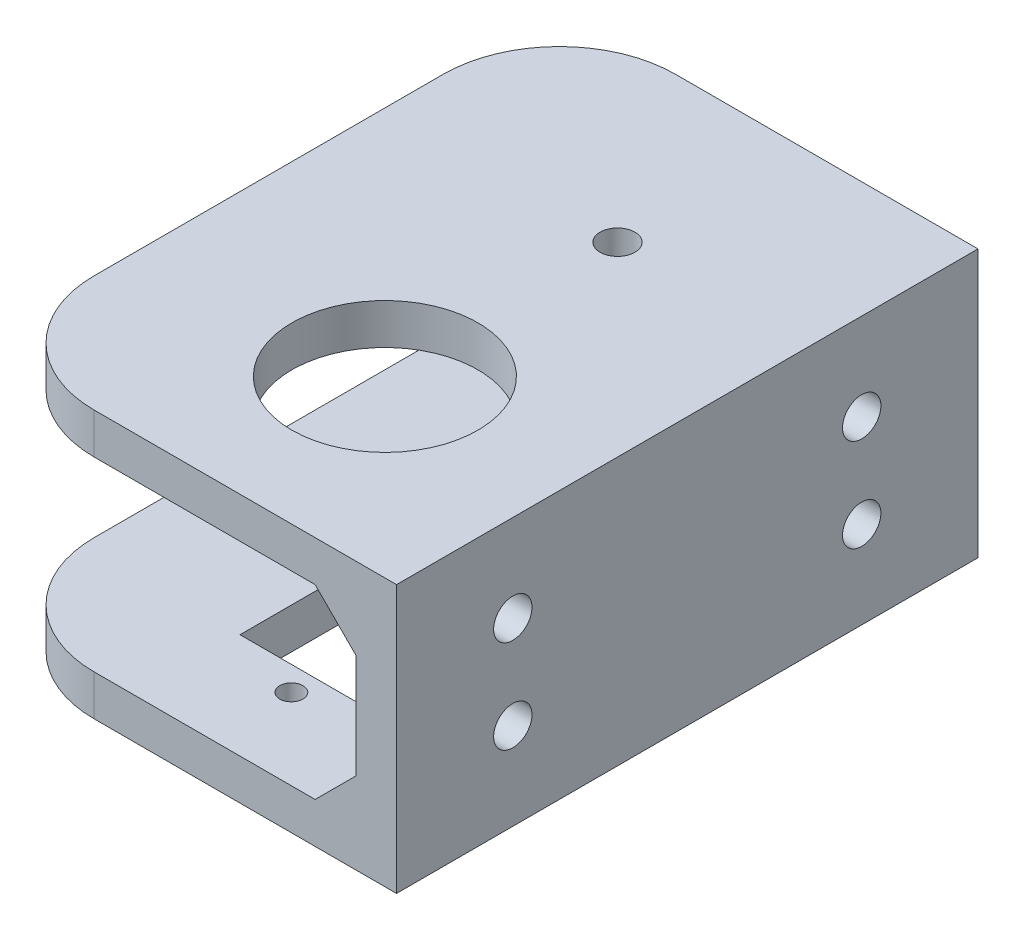
ISO-10303-21;
HEADER;
FILE_DESCRIPTION(('STEP AP214'),'2;1');
FILE_NAME('part.step','',(''),(''),'','','');
FILE_SCHEMA(('AUTOMOTIVE_DESIGN { 1 0 10303 214 1 1 1 1 }'));
ENDSEC;
DATA;
#1=APPLICATION_CONTEXT('core data for automotive mechanical design processes');
#2=APPLICATION_PROTOCOL_DEFINITION('international standard','automotive_design',2000,#1);
#3=PRODUCT_CONTEXT('',#1,'mechanical');
#4=PRODUCT('Part','Part','',(#3));
#5=PRODUCT_RELATED_PRODUCT_CATEGORY('part','',(#4));
#6=PRODUCT_DEFINITION_FORMATION('','',#4);
#7=PRODUCT_DEFINITION_CONTEXT('part definition',#1,'design');
#8=PRODUCT_DEFINITION('design','',#6,#7);
#9=PRODUCT_DEFINITION_SHAPE('','',#8);
#10=(LENGTH_UNIT() NAMED_UNIT(*) SI_UNIT(.MILLI.,.METRE.));
#11=(NAMED_UNIT(*) PLANE_ANGLE_UNIT() SI_UNIT($,.RADIAN.));
#12=(NAMED_UNIT(*) SI_UNIT($,.STERADIAN.) SOLID_ANGLE_UNIT());
#13=UNCERTAINTY_MEASURE_WITH_UNIT(LENGTH_MEASURE(1.E-05),#10,'distance_accuracy_value','');
#14=(GEOMETRIC_REPRESENTATION_CONTEXT(3) GLOBAL_UNCERTAINTY_ASSIGNED_CONTEXT((#13)) GLOBAL_UNIT_ASSIGNED_CONTEXT((#10,
#11,#12)) REPRESENTATION_CONTEXT('',''));
#15=CARTESIAN_POINT('',(0.,0.,0.));
#16=DIRECTION('',(0.,0.,1.));
#17=DIRECTION('',(1.,0.,0.));
#18=AXIS2_PLACEMENT_3D('',#15,#16,#17);
#19=CARTESIAN_POINT('',(-45.,8.,50.));
#20=DIRECTION('',(0.,1.,0.));
#21=DIRECTION('',(0.,0.,1.));
#22=AXIS2_PLACEMENT_3D('',#19,#20,#21);
#23=PLANE('',#22);
#24=CARTESIAN_POINT('',(-16.,8.,35.));
#25=DIRECTION('',(0.,1.,0.));
#26=DIRECTION('',(0.,0.,1.));
#27=AXIS2_PLACEMENT_3D('',#24,#25,#26);
#28=CIRCLE('',#27,8.);
#29=CARTESIAN_POINT('',(-16.,8.,43.));
#30=VERTEX_POINT('',#29);
#31=EDGE_CURVE('E395',#30,#30,#28,.T.);
#32=ORIENTED_EDGE('',*,*,#31,.T.);
#33=EDGE_LOOP('',(#32));
#34=FACE_BOUND('',#33,.T.);
#35=CARTESIAN_POINT('',(-16.,8.,15.));
#36=DIRECTION('',(0.,1.,0.));
#37=DIRECTION('',(0.,0.,1.));
#38=AXIS2_PLACEMENT_3D('',#35,#36,#37);
#39=CIRCLE('',#38,1.5);
#40=CARTESIAN_POINT('',(-16.,8.,16.5));
#41=VERTEX_POINT('',#40);
#42=EDGE_CURVE('E235',#41,#41,#39,.T.);
#43=ORIENTED_EDGE('',*,*,#42,.T.);
#44=EDGE_LOOP('',(#43));
#45=FACE_BOUND('',#44,.T.);
#46=DIRECTION('',(-1.,0.,0.));
#47=VECTOR('',#46,1.);
#48=CARTESIAN_POINT('',(-3.5,8.,46.5));
#49=LINE('',#48,#47);
#50=CARTESIAN_POINT('',(-3.5,8.,46.5));
#51=VERTEX_POINT('',#50);
#52=CARTESIAN_POINT('',(-7.,8.,46.5));
#53=VERTEX_POINT('',#52);
#54=EDGE_CURVE('E438',#51,#53,#49,.T.);
#55=ORIENTED_EDGE('',*,*,#54,.T.);
#56=DIRECTION('',(0.,0.,1.));
#57=VECTOR('',#56,1.);
#58=CARTESIAN_POINT('',(-7.,8.,46.5));
#59=LINE('',#58,#57);
#60=CARTESIAN_POINT('',(-7.,8.,50.));
#61=VERTEX_POINT('',#60);
#62=EDGE_CURVE('E429',#53,#61,#59,.T.);
#63=ORIENTED_EDGE('',*,*,#62,.T.);
#64=DIRECTION('',(1.,0.,0.));
#65=VECTOR('',#64,1.);
#66=CARTESIAN_POINT('',(-45.,8.,50.));
#67=LINE('',#66,#65);
#68=CARTESIAN_POINT('',(-25.9999999999999,8.,50.));
#69=VERTEX_POINT('',#68);
#70=EDGE_CURVE('E283',#69,#61,#67,.T.);
#71=ORIENTED_EDGE('',*,*,#70,.F.);
#72=CARTESIAN_POINT('',(-26.,8.,40.));
#73=DIRECTION('',(0.,1.,0.));
#74=DIRECTION('',(0.,0.,1.));
#75=AXIS2_PLACEMENT_3D('',#72,#73,#74);
#76=CIRCLE('',#75,10.);
#77=CARTESIAN_POINT('',(-36.,8.,39.9999999999999));
#78=VERTEX_POINT('',#77);
#79=EDGE_CURVE('E304',#78,#69,#76,.T.);
#80=ORIENTED_EDGE('',*,*,#79,.F.);
#81=DIRECTION('',(0.,0.,1.));
#82=VECTOR('',#81,1.);
#83=CARTESIAN_POINT('',(-36.,8.,50.));
#84=LINE('',#83,#82);
#85=CARTESIAN_POINT('',(-36.,8.,10.0000000000001));
#86=VERTEX_POINT('',#85);
#87=EDGE_CURVE('E260',#86,#78,#84,.T.);
#88=ORIENTED_EDGE('',*,*,#87,.F.);
#89=CARTESIAN_POINT('',(-26.,8.,10.));
#90=DIRECTION('',(0.,1.,0.));
#91=DIRECTION('',(0.,0.,1.));
#92=AXIS2_PLACEMENT_3D('',#89,#90,#91);
#93=CIRCLE('',#92,10.);
#94=CARTESIAN_POINT('',(-25.9999999999999,8.,0.));
#95=VERTEX_POINT('',#94);
#96=EDGE_CURVE('E247',#95,#86,#93,.T.);
#97=ORIENTED_EDGE('',*,*,#96,.F.);
#98=DIRECTION('',(1.,0.,0.));
#99=VECTOR('',#98,1.);
#100=CARTESIAN_POINT('',(-45.,8.,0.));
#101=LINE('',#100,#99);
#102=CARTESIAN_POINT('',(-7.00000000000001,8.,0.));
#103=VERTEX_POINT('',#102);
#104=EDGE_CURVE('E234',#95,#103,#101,.T.);
#105=ORIENTED_EDGE('',*,*,#104,.T.);
#106=DIRECTION('',(0.,0.,-1.));
#107=VECTOR('',#106,1.);
#108=CARTESIAN_POINT('',(-7.,8.,3.5));
#109=LINE('',#108,#107);
#110=CARTESIAN_POINT('',(-7.,8.,3.5));
#111=VERTEX_POINT('',#110);
#112=EDGE_CURVE('E402',#111,#103,#109,.T.);
#113=ORIENTED_EDGE('',*,*,#112,.F.);
#114=DIRECTION('',(1.,0.,0.));
#115=VECTOR('',#114,1.);
#116=CARTESIAN_POINT('',(-3.5,8.,3.5));
#117=LINE('',#116,#115);
#118=CARTESIAN_POINT('',(-3.5,8.,3.5));
#119=VERTEX_POINT('',#118);
#120=EDGE_CURVE('E411',#111,#119,#117,.T.);
#121=ORIENTED_EDGE('',*,*,#120,.T.);
#122=DIRECTION('',(0.,0.,-1.));
#123=VECTOR('',#122,1.);
#124=CARTESIAN_POINT('',(-3.5,8.,50.));
#125=LINE('',#124,#123);
#126=EDGE_CURVE('E221',#51,#119,#125,.T.);
#127=ORIENTED_EDGE('',*,*,#126,.F.);
#128=EDGE_LOOP('',(#55,#63,#71,#80,#88,#97,#105,#113,#121,#127));
#129=FACE_BOUND('',#128,.T.);
#130=ADVANCED_FACE('F40',(#34,#45,#129),#23,.F.);
#131=CARTESIAN_POINT('',(-3.5,-8.,50.));
#132=DIRECTION('',(0.,-1.,0.));
#133=DIRECTION('',(1.,0.,0.));
#134=AXIS2_PLACEMENT_3D('',#131,#132,#133);
#135=PLANE('',#134);
#136=DIRECTION('',(-1.,0.,0.));
#137=VECTOR('',#136,1.);
#138=CARTESIAN_POINT('',(-3.5,-8.,40.96));
#139=LINE('',#138,#137);
#140=CARTESIAN_POINT('',(-9.5,-8.,40.96));
#141=VERTEX_POINT('',#140);
#142=CARTESIAN_POINT('',(-22.5,-8.,40.96));
#143=VERTEX_POINT('',#142);
#144=EDGE_CURVE('E342',#141,#143,#139,.T.);
#145=ORIENTED_EDGE('',*,*,#144,.T.);
#146=DIRECTION('',(0.,0.,-1.));
#147=VECTOR('',#146,1.);
#148=CARTESIAN_POINT('',(-22.5,-8.,50.));
#149=LINE('',#148,#147);
#150=CARTESIAN_POINT('',(-22.5,-8.,17.46));
#151=VERTEX_POINT('',#150);
#152=EDGE_CURVE('E337',#143,#151,#149,.T.);
#153=ORIENTED_EDGE('',*,*,#152,.T.);
#154=DIRECTION('',(1.,0.,0.));
#155=VECTOR('',#154,1.);
#156=CARTESIAN_POINT('',(-3.49999999999999,-8.,17.46));
#157=LINE('',#156,#155);
#158=CARTESIAN_POINT('',(-9.5,-8.,17.46));
#159=VERTEX_POINT('',#158);
#160=EDGE_CURVE('E348',#151,#159,#157,.T.);
#161=ORIENTED_EDGE('',*,*,#160,.T.);
#162=DIRECTION('',(0.,0.,1.));
#163=VECTOR('',#162,1.);
#164=CARTESIAN_POINT('',(-9.5,-8.,50.));
#165=LINE('',#164,#163);
#166=EDGE_CURVE('E345',#159,#141,#165,.T.);
#167=ORIENTED_EDGE('',*,*,#166,.T.);
#168=EDGE_LOOP('',(#145,#153,#161,#167));
#169=FACE_BOUND('',#168,.T.);
#170=CARTESIAN_POINT('',(-16.,-8.,43.045));
#171=DIRECTION('',(0.,-1.,0.));
#172=DIRECTION('',(1.,0.,0.));
#173=AXIS2_PLACEMENT_3D('',#170,#171,#172);
#174=CIRCLE('',#173,1.);
#175=CARTESIAN_POINT('',(-15.,-8.,43.045));
#176=VERTEX_POINT('',#175);
#177=EDGE_CURVE('E327',#176,#176,#174,.T.);
#178=ORIENTED_EDGE('',*,*,#177,.T.);
#179=EDGE_LOOP('',(#178));
#180=FACE_BOUND('',#179,.T.);
#181=CARTESIAN_POINT('',(-16.,-8.,15.375));
#182=DIRECTION('',(0.,-1.,0.));
#183=DIRECTION('',(1.,0.,0.));
#184=AXIS2_PLACEMENT_3D('',#181,#182,#183);
#185=CIRCLE('',#184,1.);
#186=CARTESIAN_POINT('',(-15.,-8.,15.375));
#187=VERTEX_POINT('',#186);
#188=EDGE_CURVE('E330',#187,#187,#185,.T.);
#189=ORIENTED_EDGE('',*,*,#188,.T.);
#190=EDGE_LOOP('',(#189));
#191=FACE_BOUND('',#190,.T.);
#192=DIRECTION('',(-1.,0.,0.));
#193=VECTOR('',#192,1.);
#194=CARTESIAN_POINT('',(-3.5,-8.,50.));
#195=LINE('',#194,#193);
#196=CARTESIAN_POINT('',(-7.,-8.,50.));
#197=VERTEX_POINT('',#196);
#198=CARTESIAN_POINT('',(-25.9999999999999,-8.00000000000001,50.));
#199=VERTEX_POINT('',#198);
#200=EDGE_CURVE('E292',#197,#199,#195,.T.);
#201=ORIENTED_EDGE('',*,*,#200,.F.);
#202=DIRECTION('',(0.,0.,1.));
#203=VECTOR('',#202,1.);
#204=CARTESIAN_POINT('',(-7.,-8.,46.5));
#205=LINE('',#204,#203);
#206=CARTESIAN_POINT('',(-7.,-8.,46.5));
#207=VERTEX_POINT('',#206);
#208=EDGE_CURVE('E215',#207,#197,#205,.T.);
#209=ORIENTED_EDGE('',*,*,#208,.F.);
#210=DIRECTION('',(1.,0.,0.));
#211=VECTOR('',#210,1.);
#212=CARTESIAN_POINT('',(-7.,-8.,46.5));
#213=LINE('',#212,#211);
#214=CARTESIAN_POINT('',(-3.5,-8.,46.5));
#215=VERTEX_POINT('',#214);
#216=EDGE_CURVE('E203',#207,#215,#213,.T.);
#217=ORIENTED_EDGE('',*,*,#216,.T.);
#218=DIRECTION('',(0.,0.,-1.));
#219=VECTOR('',#218,1.);
#220=CARTESIAN_POINT('',(-3.5,-8.,50.));
#221=LINE('',#220,#219);
#222=CARTESIAN_POINT('',(-3.5,-8.,3.5));
#223=VERTEX_POINT('',#222);
#224=EDGE_CURVE('E213',#215,#223,#221,.T.);
#225=ORIENTED_EDGE('',*,*,#224,.T.);
#226=DIRECTION('',(-1.,0.,0.));
#227=VECTOR('',#226,1.);
#228=CARTESIAN_POINT('',(-3.5,-8.,3.5));
#229=LINE('',#228,#227);
#230=CARTESIAN_POINT('',(-7.,-8.,3.5));
#231=VERTEX_POINT('',#230);
#232=EDGE_CURVE('E62',#223,#231,#229,.T.);
#233=ORIENTED_EDGE('',*,*,#232,.T.);
#234=DIRECTION('',(0.,0.,-1.));
#235=VECTOR('',#234,1.);
#236=CARTESIAN_POINT('',(-7.,-8.,3.5));
#237=LINE('',#236,#235);
#238=CARTESIAN_POINT('',(-7.,-8.,0.));
#239=VERTEX_POINT('',#238);
#240=EDGE_CURVE('E416',#231,#239,#237,.T.);
#241=ORIENTED_EDGE('',*,*,#240,.T.);
#242=DIRECTION('',(-1.,0.,0.));
#243=VECTOR('',#242,1.);
#244=CARTESIAN_POINT('',(-3.5,-8.,0.));
#245=LINE('',#244,#243);
#246=CARTESIAN_POINT('',(-26.,-8.,0.));
#247=VERTEX_POINT('',#246);
#248=EDGE_CURVE('E271',#239,#247,#245,.T.);
#249=ORIENTED_EDGE('',*,*,#248,.T.);
#250=CARTESIAN_POINT('',(-26.,-7.99999999999999,10.));
#251=DIRECTION('',(0.,-1.,0.));
#252=DIRECTION('',(1.,0.,0.));
#253=AXIS2_PLACEMENT_3D('',#250,#251,#252);
#254=CIRCLE('',#253,10.);
#255=CARTESIAN_POINT('',(-36.,-8.00000000000001,10.0000000000001));
#256=VERTEX_POINT('',#255);
#257=EDGE_CURVE('E262',#256,#247,#254,.T.);
#258=ORIENTED_EDGE('',*,*,#257,.F.);
#259=DIRECTION('',(0.,0.,-1.));
#260=VECTOR('',#259,1.);
#261=CARTESIAN_POINT('',(-36.,-8.,50.));
#262=LINE('',#261,#260);
#263=CARTESIAN_POINT('',(-36.,-7.99999999999999,39.9999999999999));
#264=VERTEX_POINT('',#263);
#265=EDGE_CURVE('E302',#264,#256,#262,.T.);
#266=ORIENTED_EDGE('',*,*,#265,.F.);
#267=CARTESIAN_POINT('',(-26.,-7.99999999999999,40.));
#268=DIRECTION('',(0.,-1.,0.));
#269=DIRECTION('',(1.,0.,0.));
#270=AXIS2_PLACEMENT_3D('',#267,#268,#269);
#271=CIRCLE('',#270,10.);
#272=EDGE_CURVE('E306',#199,#264,#271,.T.);
#273=ORIENTED_EDGE('',*,*,#272,.F.);
#274=EDGE_LOOP('',(#201,#209,#217,#225,#233,#241,#249,#258,#266,#273));
#275=FACE_BOUND('',#274,.T.);
#276=ADVANCED_FACE('F212',(#169,#180,#191,#275),#135,.F.);
#277=CARTESIAN_POINT('',(0.,-11.5,50.));
#278=DIRECTION('',(0.,1.,0.));
#279=DIRECTION('',(0.,0.,1.));
#280=AXIS2_PLACEMENT_3D('',#277,#278,#279);
#281=PLANE('',#280);
#282=DIRECTION('',(1.,0.,0.));
#283=VECTOR('',#282,1.);
#284=CARTESIAN_POINT('',(-9.5,-11.5,17.46));
#285=LINE('',#284,#283);
#286=CARTESIAN_POINT('',(-22.5,-11.5,17.46));
#287=VERTEX_POINT('',#286);
#288=CARTESIAN_POINT('',(-9.5,-11.5,17.46));
#289=VERTEX_POINT('',#288);
#290=EDGE_CURVE('E366',#287,#289,#285,.T.);
#291=ORIENTED_EDGE('',*,*,#290,.F.);
#292=DIRECTION('',(0.,0.,-1.));
#293=VECTOR('',#292,1.);
#294=CARTESIAN_POINT('',(-22.5,-11.5,17.46));
#295=LINE('',#294,#293);
#296=CARTESIAN_POINT('',(-22.5,-11.5,40.96));
#297=VERTEX_POINT('',#296);
#298=EDGE_CURVE('E369',#297,#287,#295,.T.);
#299=ORIENTED_EDGE('',*,*,#298,.F.);
#300=DIRECTION('',(-1.,0.,0.));
#301=VECTOR('',#300,1.);
#302=CARTESIAN_POINT('',(-9.5,-11.5,40.96));
#303=LINE('',#302,#301);
#304=CARTESIAN_POINT('',(-9.5,-11.5,40.96));
#305=VERTEX_POINT('',#304);
#306=EDGE_CURVE('E356',#305,#297,#303,.T.);
#307=ORIENTED_EDGE('',*,*,#306,.F.);
#308=DIRECTION('',(0.,0.,1.));
#309=VECTOR('',#308,1.);
#310=CARTESIAN_POINT('',(-9.5,-11.5,17.46));
#311=LINE('',#310,#309);
#312=EDGE_CURVE('E363',#289,#305,#311,.T.);
#313=ORIENTED_EDGE('',*,*,#312,.F.);
#314=EDGE_LOOP('',(#291,#299,#307,#313));
#315=FACE_BOUND('',#314,.T.);
#316=CARTESIAN_POINT('',(-16.,-11.5,43.045));
#317=DIRECTION('',(0.,-1.,0.));
#318=DIRECTION('',(0.,0.,-1.));
#319=AXIS2_PLACEMENT_3D('',#316,#317,#318);
#320=CIRCLE('',#319,1.);
#321=CARTESIAN_POINT('',(-16.,-11.5,42.045));
#322=VERTEX_POINT('',#321);
#323=EDGE_CURVE('E333',#322,#322,#320,.T.);
#324=ORIENTED_EDGE('',*,*,#323,.F.);
#325=EDGE_LOOP('',(#324));
#326=FACE_BOUND('',#325,.T.);
#327=CARTESIAN_POINT('',(-16.,-11.5,15.375));
#328=DIRECTION('',(0.,-1.,0.));
#329=DIRECTION('',(0.,0.,-1.));
#330=AXIS2_PLACEMENT_3D('',#327,#328,#329);
#331=CIRCLE('',#330,1.);
#332=CARTESIAN_POINT('',(-16.,-11.5,14.375));
#333=VERTEX_POINT('',#332);
#334=EDGE_CURVE('E334',#333,#333,#331,.T.);
#335=ORIENTED_EDGE('',*,*,#334,.F.);
#336=EDGE_LOOP('',(#335));
#337=FACE_BOUND('',#336,.T.);
#338=CARTESIAN_POINT('',(-26.,-11.5,10.));
#339=DIRECTION('',(0.,-1.,0.));
#340=DIRECTION('',(0.,0.,1.));
#341=AXIS2_PLACEMENT_3D('',#338,#339,#340);
#342=CIRCLE('',#341,10.);
#343=CARTESIAN_POINT('',(-36.,-11.5,10.0000000000001));
#344=VERTEX_POINT('',#343);
#345=CARTESIAN_POINT('',(-25.9999999999999,-11.5,0.));
#346=VERTEX_POINT('',#345);
#347=EDGE_CURVE('E324',#344,#346,#342,.T.);
#348=ORIENTED_EDGE('',*,*,#347,.T.);
#349=DIRECTION('',(1.,0.,0.));
#350=VECTOR('',#349,1.);
#351=CARTESIAN_POINT('',(0.,-11.5,0.));
#352=LINE('',#351,#350);
#353=CARTESIAN_POINT('',(0.,-11.5,0.));
#354=VERTEX_POINT('',#353);
#355=EDGE_CURVE('E278',#346,#354,#352,.T.);
#356=ORIENTED_EDGE('',*,*,#355,.T.);
#357=DIRECTION('',(0.,0.,-1.));
#358=VECTOR('',#357,1.);
#359=CARTESIAN_POINT('',(0.,-11.5,50.));
#360=LINE('',#359,#358);
#361=CARTESIAN_POINT('',(0.,-11.5,50.));
#362=VERTEX_POINT('',#361);
#363=EDGE_CURVE('E222',#362,#354,#360,.T.);
#364=ORIENTED_EDGE('',*,*,#363,.F.);
#365=DIRECTION('',(1.,0.,0.));
#366=VECTOR('',#365,1.);
#367=CARTESIAN_POINT('',(0.,-11.5,50.));
#368=LINE('',#367,#366);
#369=CARTESIAN_POINT('',(-25.9999999999999,-11.5,50.));
#370=VERTEX_POINT('',#369);
#371=EDGE_CURVE('E290',#370,#362,#368,.T.);
#372=ORIENTED_EDGE('',*,*,#371,.F.);
#373=CARTESIAN_POINT('',(-26.,-11.5,40.));
#374=DIRECTION('',(0.,-1.,0.));
#375=DIRECTION('',(0.,0.,1.));
#376=AXIS2_PLACEMENT_3D('',#373,#374,#375);
#377=CIRCLE('',#376,10.);
#378=CARTESIAN_POINT('',(-36.,-11.5,39.9999999999999));
#379=VERTEX_POINT('',#378);
#380=EDGE_CURVE('E321',#370,#379,#377,.T.);
#381=ORIENTED_EDGE('',*,*,#380,.T.);
#382=DIRECTION('',(0.,0.,-1.));
#383=VECTOR('',#382,1.);
#384=CARTESIAN_POINT('',(-36.,-11.5,10.0000000000001));
#385=LINE('',#384,#383);
#386=EDGE_CURVE('E316',#379,#344,#385,.T.);
#387=ORIENTED_EDGE('',*,*,#386,.T.);
#388=EDGE_LOOP('',(#348,#356,#364,#372,#381,#387));
#389=FACE_BOUND('',#388,.T.);
#390=ADVANCED_FACE('F464',(#315,#326,#337,#389),#281,.F.);
#391=CARTESIAN_POINT('',(-45.,11.5,50.));
#392=DIRECTION('',(0.,-1.,0.));
#393=DIRECTION('',(0.,0.,-1.));
#394=AXIS2_PLACEMENT_3D('',#391,#392,#393);
#395=PLANE('',#394);
#396=CARTESIAN_POINT('',(-16.,11.5,35.));
#397=DIRECTION('',(0.,1.,0.));
#398=DIRECTION('',(0.,0.,1.));
#399=AXIS2_PLACEMENT_3D('',#396,#397,#398);
#400=CIRCLE('',#399,8.);
#401=CARTESIAN_POINT('',(-16.,11.5,43.));
#402=VERTEX_POINT('',#401);
#403=EDGE_CURVE('E398',#402,#402,#400,.T.);
#404=ORIENTED_EDGE('',*,*,#403,.F.);
#405=EDGE_LOOP('',(#404));
#406=FACE_BOUND('',#405,.T.);
#407=CARTESIAN_POINT('',(-16.,11.5,15.));
#408=DIRECTION('',(0.,-1.,0.));
#409=DIRECTION('',(0.,0.,-1.));
#410=AXIS2_PLACEMENT_3D('',#407,#408,#409);
#411=CIRCLE('',#410,1.5);
#412=CARTESIAN_POINT('',(-16.,11.5,13.5));
#413=VERTEX_POINT('',#412);
#414=EDGE_CURVE('E231',#413,#413,#411,.F.);
#415=ORIENTED_EDGE('',*,*,#414,.F.);
#416=EDGE_LOOP('',(#415));
#417=FACE_BOUND('',#416,.T.);
#418=CARTESIAN_POINT('',(-26.,11.5,10.));
#419=DIRECTION('',(0.,-1.,0.));
#420=DIRECTION('',(0.,0.,-1.));
#421=AXIS2_PLACEMENT_3D('',#418,#419,#420);
#422=CIRCLE('',#421,10.);
#423=CARTESIAN_POINT('',(-36.,11.5,10.0000000000001));
#424=VERTEX_POINT('',#423);
#425=CARTESIAN_POINT('',(-26.,11.5,0.));
#426=VERTEX_POINT('',#425);
#427=EDGE_CURVE('E250',#424,#426,#422,.T.);
#428=ORIENTED_EDGE('',*,*,#427,.F.);
#429=DIRECTION('',(0.,0.,-1.));
#430=VECTOR('',#429,1.);
#431=CARTESIAN_POINT('',(-36.,11.5,50.));
#432=LINE('',#431,#430);
#433=CARTESIAN_POINT('',(-36.,11.5,39.9999999999999));
#434=VERTEX_POINT('',#433);
#435=EDGE_CURVE('E12',#434,#424,#432,.T.);
#436=ORIENTED_EDGE('',*,*,#435,.F.);
#437=CARTESIAN_POINT('',(-26.,11.5,40.));
#438=DIRECTION('',(0.,-1.,0.));
#439=DIRECTION('',(0.,0.,-1.));
#440=AXIS2_PLACEMENT_3D('',#437,#438,#439);
#441=CIRCLE('',#440,10.);
#442=CARTESIAN_POINT('',(-25.9999999999999,11.5,50.));
#443=VERTEX_POINT('',#442);
#444=EDGE_CURVE('E261',#443,#434,#441,.T.);
#445=ORIENTED_EDGE('',*,*,#444,.F.);
#446=DIRECTION('',(-1.,0.,0.));
#447=VECTOR('',#446,1.);
#448=CARTESIAN_POINT('',(-45.,11.5,50.));
#449=LINE('',#448,#447);
#450=CARTESIAN_POINT('',(0.,11.5,50.));
#451=VERTEX_POINT('',#450);
#452=EDGE_CURVE('E274',#451,#443,#449,.T.);
#453=ORIENTED_EDGE('',*,*,#452,.F.);
#454=DIRECTION('',(0.,0.,-1.));
#455=VECTOR('',#454,1.);
#456=CARTESIAN_POINT('',(0.,11.5,50.));
#457=LINE('',#456,#455);
#458=CARTESIAN_POINT('',(0.,11.5,0.));
#459=VERTEX_POINT('',#458);
#460=EDGE_CURVE('E227',#451,#459,#457,.T.);
#461=ORIENTED_EDGE('',*,*,#460,.T.);
#462=DIRECTION('',(-1.,0.,0.));
#463=VECTOR('',#462,1.);
#464=CARTESIAN_POINT('',(-45.,11.5,0.));
#465=LINE('',#464,#463);
#466=EDGE_CURVE('E282',#459,#426,#465,.T.);
#467=ORIENTED_EDGE('',*,*,#466,.T.);
#468=EDGE_LOOP('',(#428,#436,#445,#453,#461,#467));
#469=FACE_BOUND('',#468,.T.);
#470=ADVANCED_FACE('F471',(#406,#417,#469),#395,.F.);
#471=CARTESIAN_POINT('',(0.,0.,50.));
#472=DIRECTION('',(0.,0.,1.));
#473=DIRECTION('',(1.,0.,0.));
#474=AXIS2_PLACEMENT_3D('',#471,#472,#473);
#475=PLANE('',#474);
#476=DIRECTION('',(-0.707106781186548,-0.707106781186547,0.));
#477=VECTOR('',#476,1.);
#478=CARTESIAN_POINT('',(-3.5,-4.5,50.));
#479=LINE('',#478,#477);
#480=CARTESIAN_POINT('',(-3.5,-4.5,50.));
#481=VERTEX_POINT('',#480);
#482=EDGE_CURVE('E216',#481,#197,#479,.T.);
#483=ORIENTED_EDGE('',*,*,#482,.T.);
#484=ORIENTED_EDGE('',*,*,#200,.T.);
#485=DIRECTION('',(0.,-1.,0.));
#486=VECTOR('',#485,1.);
#487=CARTESIAN_POINT('',(-26.,58.5,50.));
#488=LINE('',#487,#486);
#489=EDGE_CURVE('E237',#199,#370,#488,.T.);
#490=ORIENTED_EDGE('',*,*,#489,.T.);
#491=ORIENTED_EDGE('',*,*,#371,.T.);
#492=DIRECTION('',(0.,1.,0.));
#493=VECTOR('',#492,1.);
#494=CARTESIAN_POINT('',(0.,11.5,50.));
#495=LINE('',#494,#493);
#496=EDGE_CURVE('E289',#362,#451,#495,.T.);
#497=ORIENTED_EDGE('',*,*,#496,.T.);
#498=ORIENTED_EDGE('',*,*,#452,.T.);
#499=EDGE_CURVE('E47',#443,#69,#488,.T.);
#500=ORIENTED_EDGE('',*,*,#499,.T.);
#501=ORIENTED_EDGE('',*,*,#70,.T.);
#502=DIRECTION('',(0.707106781186548,-0.707106781186547,0.));
#503=VECTOR('',#502,1.);
#504=CARTESIAN_POINT('',(-7.,8.,50.));
#505=LINE('',#504,#503);
#506=CARTESIAN_POINT('',(-3.5,4.5,50.));
#507=VERTEX_POINT('',#506);
#508=EDGE_CURVE('E54',#61,#507,#505,.T.);
#509=ORIENTED_EDGE('',*,*,#508,.T.);
#510=DIRECTION('',(0.,-1.,0.));
#511=VECTOR('',#510,1.);
#512=CARTESIAN_POINT('',(-3.5,8.,50.));
#513=LINE('',#512,#511);
#514=EDGE_CURVE('E296',#507,#481,#513,.T.);
#515=ORIENTED_EDGE('',*,*,#514,.T.);
#516=EDGE_LOOP('',(#483,#484,#490,#491,#497,#498,#500,#501,#509,#515));
#517=FACE_BOUND('',#516,.T.);
#518=ADVANCED_FACE('F451',(#517),#475,.T.);
#519=CARTESIAN_POINT('',(0.,0.,0.));
#520=DIRECTION('',(0.,0.,1.));
#521=DIRECTION('',(1.,0.,0.));
#522=AXIS2_PLACEMENT_3D('',#519,#520,#521);
#523=PLANE('',#522);
#524=ORIENTED_EDGE('',*,*,#248,.F.);
#525=DIRECTION('',(0.707106781186548,0.707106781186547,0.));
#526=VECTOR('',#525,1.);
#527=CARTESIAN_POINT('',(-7.,-8.,0.));
#528=LINE('',#527,#526);
#529=CARTESIAN_POINT('',(-3.5,-4.5,0.));
#530=VERTEX_POINT('',#529);
#531=EDGE_CURVE('E421',#239,#530,#528,.T.);
#532=ORIENTED_EDGE('',*,*,#531,.T.);
#533=DIRECTION('',(0.,-1.,0.));
#534=VECTOR('',#533,1.);
#535=CARTESIAN_POINT('',(-3.5,8.,0.));
#536=LINE('',#535,#534);
#537=CARTESIAN_POINT('',(-3.5,4.5,0.));
#538=VERTEX_POINT('',#537);
#539=EDGE_CURVE('E269',#538,#530,#536,.T.);
#540=ORIENTED_EDGE('',*,*,#539,.F.);
#541=DIRECTION('',(-0.707106781186548,0.707106781186547,0.));
#542=VECTOR('',#541,1.);
#543=CARTESIAN_POINT('',(-7.,8.,0.));
#544=LINE('',#543,#542);
#545=EDGE_CURVE('E268',#538,#103,#544,.T.);
#546=ORIENTED_EDGE('',*,*,#545,.T.);
#547=ORIENTED_EDGE('',*,*,#104,.F.);
#548=DIRECTION('',(0.,-1.,0.));
#549=VECTOR('',#548,1.);
#550=CARTESIAN_POINT('',(-26.,58.5,0.));
#551=LINE('',#550,#549);
#552=EDGE_CURVE('E236',#426,#95,#551,.T.);
#553=ORIENTED_EDGE('',*,*,#552,.F.);
#554=ORIENTED_EDGE('',*,*,#466,.F.);
#555=DIRECTION('',(0.,1.,0.));
#556=VECTOR('',#555,1.);
#557=CARTESIAN_POINT('',(0.,11.5,0.));
#558=LINE('',#557,#556);
#559=EDGE_CURVE('E280',#354,#459,#558,.T.);
#560=ORIENTED_EDGE('',*,*,#559,.F.);
#561=ORIENTED_EDGE('',*,*,#355,.F.);
#562=EDGE_CURVE('E224',#247,#346,#551,.T.);
#563=ORIENTED_EDGE('',*,*,#562,.F.);
#564=EDGE_LOOP('',(#524,#532,#540,#546,#547,#553,#554,#560,#561,#563));
#565=FACE_BOUND('',#564,.T.);
#566=ADVANCED_FACE('F266',(#565),#523,.F.);
#567=CARTESIAN_POINT('',(-3.5,8.,50.));
#568=DIRECTION('',(1.,0.,0.));
#569=DIRECTION('',(0.,1.,0.));
#570=AXIS2_PLACEMENT_3D('',#567,#568,#569);
#571=PLANE('',#570);
#572=CARTESIAN_POINT('',(-3.5,3.99999999999999,40.));
#573=DIRECTION('',(1.,0.,0.));
#574=DIRECTION('',(0.,1.,0.));
#575=AXIS2_PLACEMENT_3D('',#572,#573,#574);
#576=CIRCLE('',#575,1.65);
#577=CARTESIAN_POINT('',(-3.5,5.65,40.));
#578=VERTEX_POINT('',#577);
#579=EDGE_CURVE('E371',#578,#578,#576,.T.);
#580=ORIENTED_EDGE('',*,*,#579,.T.);
#581=EDGE_LOOP('',(#580));
#582=FACE_BOUND('',#581,.T.);
#583=CARTESIAN_POINT('',(-3.5,-3.99999999999999,10.));
#584=DIRECTION('',(1.,0.,0.));
#585=DIRECTION('',(0.,1.,0.));
#586=AXIS2_PLACEMENT_3D('',#583,#584,#585);
#587=CIRCLE('',#586,1.65);
#588=CARTESIAN_POINT('',(-3.5,-2.34999999999999,10.));
#589=VERTEX_POINT('',#588);
#590=EDGE_CURVE('E374',#589,#589,#587,.T.);
#591=ORIENTED_EDGE('',*,*,#590,.T.);
#592=EDGE_LOOP('',(#591));
#593=FACE_BOUND('',#592,.T.);
#594=CARTESIAN_POINT('',(-3.5,-3.99999999999999,40.));
#595=DIRECTION('',(1.,0.,0.));
#596=DIRECTION('',(0.,1.,0.));
#597=AXIS2_PLACEMENT_3D('',#594,#595,#596);
#598=CIRCLE('',#597,1.65);
#599=CARTESIAN_POINT('',(-3.5,-2.34999999999999,40.));
#600=VERTEX_POINT('',#599);
#601=EDGE_CURVE('E377',#600,#600,#598,.T.);
#602=ORIENTED_EDGE('',*,*,#601,.T.);
#603=EDGE_LOOP('',(#602));
#604=FACE_BOUND('',#603,.T.);
#605=CARTESIAN_POINT('',(-3.5,3.99999999999999,10.));
#606=DIRECTION('',(1.,0.,0.));
#607=DIRECTION('',(0.,1.,0.));
#608=AXIS2_PLACEMENT_3D('',#605,#606,#607);
#609=CIRCLE('',#608,1.65);
#610=CARTESIAN_POINT('',(-3.5,5.65,10.));
#611=VERTEX_POINT('',#610);
#612=EDGE_CURVE('E380',#611,#611,#609,.T.);
#613=ORIENTED_EDGE('',*,*,#612,.T.);
#614=EDGE_LOOP('',(#613));
#615=FACE_BOUND('',#614,.T.);
#616=DIRECTION('',(0.,1.,0.));
#617=VECTOR('',#616,1.);
#618=CARTESIAN_POINT('',(-3.5,-8.,46.5));
#619=LINE('',#618,#617);
#620=CARTESIAN_POINT('',(-3.5,-4.5,46.5));
#621=VERTEX_POINT('',#620);
#622=EDGE_CURVE('E200',#215,#621,#619,.T.);
#623=ORIENTED_EDGE('',*,*,#622,.T.);
#624=DIRECTION('',(0.,0.,1.));
#625=VECTOR('',#624,1.);
#626=CARTESIAN_POINT('',(-3.5,-4.5,46.5));
#627=LINE('',#626,#625);
#628=EDGE_CURVE('E442',#621,#481,#627,.T.);
#629=ORIENTED_EDGE('',*,*,#628,.T.);
#630=ORIENTED_EDGE('',*,*,#514,.F.);
#631=DIRECTION('',(0.,0.,1.));
#632=VECTOR('',#631,1.);
#633=CARTESIAN_POINT('',(-3.5,4.5,46.5));
#634=LINE('',#633,#632);
#635=CARTESIAN_POINT('',(-3.5,4.5,46.5));
#636=VERTEX_POINT('',#635);
#637=EDGE_CURVE('E424',#636,#507,#634,.T.);
#638=ORIENTED_EDGE('',*,*,#637,.F.);
#639=DIRECTION('',(0.,1.,0.));
#640=VECTOR('',#639,1.);
#641=CARTESIAN_POINT('',(-3.5,4.5,46.5));
#642=LINE('',#641,#640);
#643=EDGE_CURVE('E435',#636,#51,#642,.T.);
#644=ORIENTED_EDGE('',*,*,#643,.T.);
#645=ORIENTED_EDGE('',*,*,#126,.T.);
#646=DIRECTION('',(0.,-1.,0.));
#647=VECTOR('',#646,1.);
#648=CARTESIAN_POINT('',(-3.5,4.5,3.5));
#649=LINE('',#648,#647);
#650=CARTESIAN_POINT('',(-3.5,4.5,3.5));
#651=VERTEX_POINT('',#650);
#652=EDGE_CURVE('E404',#119,#651,#649,.T.);
#653=ORIENTED_EDGE('',*,*,#652,.T.);
#654=DIRECTION('',(0.,0.,-1.));
#655=VECTOR('',#654,1.);
#656=CARTESIAN_POINT('',(-3.5,4.5,3.5));
#657=LINE('',#656,#655);
#658=EDGE_CURVE('E401',#651,#538,#657,.T.);
#659=ORIENTED_EDGE('',*,*,#658,.T.);
#660=ORIENTED_EDGE('',*,*,#539,.T.);
#661=DIRECTION('',(0.,0.,-1.));
#662=VECTOR('',#661,1.);
#663=CARTESIAN_POINT('',(-3.5,-4.5,3.5));
#664=LINE('',#663,#662);
#665=CARTESIAN_POINT('',(-3.5,-4.5,3.5));
#666=VERTEX_POINT('',#665);
#667=EDGE_CURVE('E409',#666,#530,#664,.T.);
#668=ORIENTED_EDGE('',*,*,#667,.F.);
#669=DIRECTION('',(0.,-1.,0.));
#670=VECTOR('',#669,1.);
#671=CARTESIAN_POINT('',(-3.5,-4.5,3.5));
#672=LINE('',#671,#670);
#673=EDGE_CURVE('E220',#666,#223,#672,.T.);
#674=ORIENTED_EDGE('',*,*,#673,.T.);
#675=ORIENTED_EDGE('',*,*,#224,.F.);
#676=EDGE_LOOP('',(#623,#629,#630,#638,#644,#645,#653,#659,#660,#668,#674,#675));
#677=FACE_BOUND('',#676,.T.);
#678=ADVANCED_FACE('F218',(#582,#593,#604,#615,#677),#571,.F.);
#679=CARTESIAN_POINT('',(0.,11.5,50.));
#680=DIRECTION('',(-1.,0.,0.));
#681=DIRECTION('',(0.,0.,1.));
#682=AXIS2_PLACEMENT_3D('',#679,#680,#681);
#683=PLANE('',#682);
#684=CARTESIAN_POINT('',(0.,3.99999999999999,40.));
#685=DIRECTION('',(1.,0.,0.));
#686=DIRECTION('',(0.,0.,-1.));
#687=AXIS2_PLACEMENT_3D('',#684,#685,#686);
#688=CIRCLE('',#687,1.65);
#689=CARTESIAN_POINT('',(0.,3.99999999999999,38.35));
#690=VERTEX_POINT('',#689);
#691=EDGE_CURVE('E386',#690,#690,#688,.T.);
#692=ORIENTED_EDGE('',*,*,#691,.F.);
#693=EDGE_LOOP('',(#692));
#694=FACE_BOUND('',#693,.T.);
#695=CARTESIAN_POINT('',(0.,-3.99999999999999,10.));
#696=DIRECTION('',(1.,0.,0.));
#697=DIRECTION('',(0.,0.,1.));
#698=AXIS2_PLACEMENT_3D('',#695,#696,#697);
#699=CIRCLE('',#698,1.65);
#700=CARTESIAN_POINT('',(0.,-3.99999999999999,11.65));
#701=VERTEX_POINT('',#700);
#702=EDGE_CURVE('E387',#701,#701,#699,.T.);
#703=ORIENTED_EDGE('',*,*,#702,.F.);
#704=EDGE_LOOP('',(#703));
#705=FACE_BOUND('',#704,.T.);
#706=CARTESIAN_POINT('',(0.,-3.99999999999999,40.));
#707=DIRECTION('',(1.,0.,0.));
#708=DIRECTION('',(0.,0.,1.));
#709=AXIS2_PLACEMENT_3D('',#706,#707,#708);
#710=CIRCLE('',#709,1.65);
#711=CARTESIAN_POINT('',(0.,-3.99999999999999,41.65));
#712=VERTEX_POINT('',#711);
#713=EDGE_CURVE('E390',#712,#712,#710,.T.);
#714=ORIENTED_EDGE('',*,*,#713,.F.);
#715=EDGE_LOOP('',(#714));
#716=FACE_BOUND('',#715,.T.);
#717=CARTESIAN_POINT('',(0.,3.99999999999999,10.));
#718=DIRECTION('',(1.,0.,0.));
#719=DIRECTION('',(0.,0.,-1.));
#720=AXIS2_PLACEMENT_3D('',#717,#718,#719);
#721=CIRCLE('',#720,1.65);
#722=CARTESIAN_POINT('',(0.,3.99999999999999,8.35));
#723=VERTEX_POINT('',#722);
#724=EDGE_CURVE('E383',#723,#723,#721,.T.);
#725=ORIENTED_EDGE('',*,*,#724,.F.);
#726=EDGE_LOOP('',(#725));
#727=FACE_BOUND('',#726,.T.);
#728=ORIENTED_EDGE('',*,*,#559,.T.);
#729=ORIENTED_EDGE('',*,*,#460,.F.);
#730=ORIENTED_EDGE('',*,*,#496,.F.);
#731=ORIENTED_EDGE('',*,*,#363,.T.);
#732=EDGE_LOOP('',(#728,#729,#730,#731));
#733=FACE_BOUND('',#732,.T.);
#734=ADVANCED_FACE('F469',(#694,#705,#716,#727,#733),#683,.F.);
#735=CARTESIAN_POINT('',(-16.,78.,15.));
#736=DIRECTION('',(0.,-1.,0.));
#737=DIRECTION('',(0.,0.,-1.));
#738=AXIS2_PLACEMENT_3D('',#735,#736,#737);
#739=CYLINDRICAL_SURFACE('',#738,1.5);
#740=ORIENTED_EDGE('',*,*,#42,.F.);
#741=EDGE_LOOP('',(#740));
#742=FACE_BOUND('',#741,.T.);
#743=ORIENTED_EDGE('',*,*,#414,.T.);
#744=EDGE_LOOP('',(#743));
#745=FACE_BOUND('',#744,.T.);
#746=ADVANCED_FACE('F511',(#742,#745),#739,.F.);
#747=CARTESIAN_POINT('',(-26.,58.5,10.));
#748=DIRECTION('',(0.,-1.,0.));
#749=DIRECTION('',(0.,0.,-1.));
#750=AXIS2_PLACEMENT_3D('',#747,#748,#749);
#751=CYLINDRICAL_SURFACE('',#750,10.);
#752=ORIENTED_EDGE('',*,*,#257,.T.);
#753=ORIENTED_EDGE('',*,*,#562,.T.);
#754=ORIENTED_EDGE('',*,*,#347,.F.);
#755=DIRECTION('',(0.,-1.,0.));
#756=VECTOR('',#755,1.);
#757=CARTESIAN_POINT('',(-36.,58.5,10.0000000000001));
#758=LINE('',#757,#756);
#759=EDGE_CURVE('E317',#256,#344,#758,.T.);
#760=ORIENTED_EDGE('',*,*,#759,.F.);
#761=EDGE_LOOP('',(#752,#753,#754,#760));
#762=FACE_BOUND('',#761,.T.);
#763=ADVANCED_FACE('F482',(#762),#751,.T.);
#764=CARTESIAN_POINT('',(-26.,58.5,40.));
#765=DIRECTION('',(0.,-1.,0.));
#766=DIRECTION('',(0.,0.,-1.));
#767=AXIS2_PLACEMENT_3D('',#764,#765,#766);
#768=CYLINDRICAL_SURFACE('',#767,10.);
#769=ORIENTED_EDGE('',*,*,#272,.T.);
#770=DIRECTION('',(0.,-1.,0.));
#771=VECTOR('',#770,1.);
#772=CARTESIAN_POINT('',(-36.,58.5,39.9999999999999));
#773=LINE('',#772,#771);
#774=EDGE_CURVE('E313',#264,#379,#773,.T.);
#775=ORIENTED_EDGE('',*,*,#774,.T.);
#776=ORIENTED_EDGE('',*,*,#380,.F.);
#777=ORIENTED_EDGE('',*,*,#489,.F.);
#778=EDGE_LOOP('',(#769,#775,#776,#777));
#779=FACE_BOUND('',#778,.T.);
#780=ADVANCED_FACE('F457',(#779),#768,.T.);
#781=CARTESIAN_POINT('',(-36.,58.5,10.0000000000001));
#782=DIRECTION('',(-1.,0.,0.));
#783=DIRECTION('',(0.,0.,1.));
#784=AXIS2_PLACEMENT_3D('',#781,#782,#783);
#785=PLANE('',#784);
#786=ORIENTED_EDGE('',*,*,#265,.T.);
#787=ORIENTED_EDGE('',*,*,#759,.T.);
#788=ORIENTED_EDGE('',*,*,#386,.F.);
#789=ORIENTED_EDGE('',*,*,#774,.F.);
#790=EDGE_LOOP('',(#786,#787,#788,#789));
#791=FACE_BOUND('',#790,.T.);
#792=ADVANCED_FACE('F460',(#791),#785,.T.);
#793=ORIENTED_EDGE('',*,*,#87,.T.);
#794=EDGE_CURVE('E315',#434,#78,#773,.T.);
#795=ORIENTED_EDGE('',*,*,#794,.F.);
#796=ORIENTED_EDGE('',*,*,#435,.T.);
#797=EDGE_CURVE('E312',#424,#86,#758,.T.);
#798=ORIENTED_EDGE('',*,*,#797,.T.);
#799=EDGE_LOOP('',(#793,#795,#796,#798));
#800=FACE_BOUND('',#799,.T.);
#801=ADVANCED_FACE('F478',(#800),#785,.T.);
#802=ORIENTED_EDGE('',*,*,#79,.T.);
#803=ORIENTED_EDGE('',*,*,#499,.F.);
#804=ORIENTED_EDGE('',*,*,#444,.T.);
#805=ORIENTED_EDGE('',*,*,#794,.T.);
#806=EDGE_LOOP('',(#802,#803,#804,#805));
#807=FACE_BOUND('',#806,.T.);
#808=ADVANCED_FACE('F476',(#807),#768,.T.);
#809=ORIENTED_EDGE('',*,*,#96,.T.);
#810=ORIENTED_EDGE('',*,*,#797,.F.);
#811=ORIENTED_EDGE('',*,*,#427,.T.);
#812=ORIENTED_EDGE('',*,*,#552,.T.);
#813=EDGE_LOOP('',(#809,#810,#811,#812));
#814=FACE_BOUND('',#813,.T.);
#815=ADVANCED_FACE('F245',(#814),#751,.T.);
#816=CARTESIAN_POINT('',(-16.,-1.5,15.375));
#817=DIRECTION('',(0.,-1.,0.));
#818=DIRECTION('',(0.,0.,-1.));
#819=AXIS2_PLACEMENT_3D('',#816,#817,#818);
#820=CYLINDRICAL_SURFACE('',#819,1.);
#821=ORIENTED_EDGE('',*,*,#334,.T.);
#822=EDGE_LOOP('',(#821));
#823=FACE_BOUND('',#822,.T.);
#824=ORIENTED_EDGE('',*,*,#188,.F.);
#825=EDGE_LOOP('',(#824));
#826=FACE_BOUND('',#825,.T.);
#827=ADVANCED_FACE('F578',(#823,#826),#820,.F.);
#828=CARTESIAN_POINT('',(-16.,-1.5,43.045));
#829=DIRECTION('',(0.,-1.,0.));
#830=DIRECTION('',(0.,0.,-1.));
#831=AXIS2_PLACEMENT_3D('',#828,#829,#830);
#832=CYLINDRICAL_SURFACE('',#831,1.);
#833=ORIENTED_EDGE('',*,*,#323,.T.);
#834=EDGE_LOOP('',(#833));
#835=FACE_BOUND('',#834,.T.);
#836=ORIENTED_EDGE('',*,*,#177,.F.);
#837=EDGE_LOOP('',(#836));
#838=FACE_BOUND('',#837,.T.);
#839=ADVANCED_FACE('F574',(#835,#838),#832,.F.);
#840=CARTESIAN_POINT('',(-22.5,-1.5,17.46));
#841=DIRECTION('',(-1.,0.,0.));
#842=DIRECTION('',(0.,0.,1.));
#843=AXIS2_PLACEMENT_3D('',#840,#841,#842);
#844=PLANE('',#843);
#845=DIRECTION('',(0.,-1.,0.));
#846=VECTOR('',#845,1.);
#847=CARTESIAN_POINT('',(-22.5,-1.5,40.96));
#848=LINE('',#847,#846);
#849=EDGE_CURVE('E351',#143,#297,#848,.T.);
#850=ORIENTED_EDGE('',*,*,#849,.T.);
#851=ORIENTED_EDGE('',*,*,#298,.T.);
#852=DIRECTION('',(0.,-1.,0.));
#853=VECTOR('',#852,1.);
#854=CARTESIAN_POINT('',(-22.5,-1.5,17.46));
#855=LINE('',#854,#853);
#856=EDGE_CURVE('E352',#151,#287,#855,.T.);
#857=ORIENTED_EDGE('',*,*,#856,.F.);
#858=ORIENTED_EDGE('',*,*,#152,.F.);
#859=EDGE_LOOP('',(#850,#851,#857,#858));
#860=FACE_BOUND('',#859,.T.);
#861=ADVANCED_FACE('F567',(#860),#844,.F.);
#862=CARTESIAN_POINT('',(-9.5,-1.5,40.96));
#863=DIRECTION('',(0.,0.,1.));
#864=DIRECTION('',(1.,0.,0.));
#865=AXIS2_PLACEMENT_3D('',#862,#863,#864);
#866=PLANE('',#865);
#867=DIRECTION('',(0.,-1.,0.));
#868=VECTOR('',#867,1.);
#869=CARTESIAN_POINT('',(-9.5,-1.5,40.96));
#870=LINE('',#869,#868);
#871=EDGE_CURVE('E358',#141,#305,#870,.T.);
#872=ORIENTED_EDGE('',*,*,#871,.T.);
#873=ORIENTED_EDGE('',*,*,#306,.T.);
#874=ORIENTED_EDGE('',*,*,#849,.F.);
#875=ORIENTED_EDGE('',*,*,#144,.F.);
#876=EDGE_LOOP('',(#872,#873,#874,#875));
#877=FACE_BOUND('',#876,.T.);
#878=ADVANCED_FACE('F564',(#877),#866,.F.);
#879=CARTESIAN_POINT('',(-9.5,-1.5,17.46));
#880=DIRECTION('',(1.,0.,0.));
#881=DIRECTION('',(0.,0.,-1.));
#882=AXIS2_PLACEMENT_3D('',#879,#880,#881);
#883=PLANE('',#882);
#884=DIRECTION('',(0.,-1.,0.));
#885=VECTOR('',#884,1.);
#886=CARTESIAN_POINT('',(-9.5,-1.5,17.46));
#887=LINE('',#886,#885);
#888=EDGE_CURVE('E355',#159,#289,#887,.T.);
#889=ORIENTED_EDGE('',*,*,#888,.T.);
#890=ORIENTED_EDGE('',*,*,#312,.T.);
#891=ORIENTED_EDGE('',*,*,#871,.F.);
#892=ORIENTED_EDGE('',*,*,#166,.F.);
#893=EDGE_LOOP('',(#889,#890,#891,#892));
#894=FACE_BOUND('',#893,.T.);
#895=ADVANCED_FACE('F558',(#894),#883,.F.);
#896=CARTESIAN_POINT('',(-9.5,-1.5,17.46));
#897=DIRECTION('',(0.,0.,-1.));
#898=DIRECTION('',(-1.,0.,0.));
#899=AXIS2_PLACEMENT_3D('',#896,#897,#898);
#900=PLANE('',#899);
#901=ORIENTED_EDGE('',*,*,#856,.T.);
#902=ORIENTED_EDGE('',*,*,#290,.T.);
#903=ORIENTED_EDGE('',*,*,#888,.F.);
#904=ORIENTED_EDGE('',*,*,#160,.F.);
#905=EDGE_LOOP('',(#901,#902,#903,#904));
#906=FACE_BOUND('',#905,.T.);
#907=ADVANCED_FACE('F548',(#906),#900,.F.);
#908=CARTESIAN_POINT('',(-10.,3.99999999999999,10.));
#909=DIRECTION('',(1.,0.,0.));
#910=DIRECTION('',(0.,0.,-1.));
#911=AXIS2_PLACEMENT_3D('',#908,#909,#910);
#912=CYLINDRICAL_SURFACE('',#911,1.65);
#913=ORIENTED_EDGE('',*,*,#724,.T.);
#914=EDGE_LOOP('',(#913));
#915=FACE_BOUND('',#914,.T.);
#916=ORIENTED_EDGE('',*,*,#612,.F.);
#917=EDGE_LOOP('',(#916));
#918=FACE_BOUND('',#917,.T.);
#919=ADVANCED_FACE('F545',(#915,#918),#912,.F.);
#920=CARTESIAN_POINT('',(-10.,-3.99999999999999,40.));
#921=DIRECTION('',(1.,0.,0.));
#922=DIRECTION('',(0.,0.,-1.));
#923=AXIS2_PLACEMENT_3D('',#920,#921,#922);
#924=CYLINDRICAL_SURFACE('',#923,1.65);
#925=ORIENTED_EDGE('',*,*,#713,.T.);
#926=EDGE_LOOP('',(#925));
#927=FACE_BOUND('',#926,.T.);
#928=ORIENTED_EDGE('',*,*,#601,.F.);
#929=EDGE_LOOP('',(#928));
#930=FACE_BOUND('',#929,.T.);
#931=ADVANCED_FACE('F547',(#927,#930),#924,.F.);
#932=CARTESIAN_POINT('',(-10.,-3.99999999999999,10.));
#933=DIRECTION('',(1.,0.,0.));
#934=DIRECTION('',(0.,0.,-1.));
#935=AXIS2_PLACEMENT_3D('',#932,#933,#934);
#936=CYLINDRICAL_SURFACE('',#935,1.65);
#937=ORIENTED_EDGE('',*,*,#702,.T.);
#938=EDGE_LOOP('',(#937));
#939=FACE_BOUND('',#938,.T.);
#940=ORIENTED_EDGE('',*,*,#590,.F.);
#941=EDGE_LOOP('',(#940));
#942=FACE_BOUND('',#941,.T.);
#943=ADVANCED_FACE('F555',(#939,#942),#936,.F.);
#944=CARTESIAN_POINT('',(-10.,3.99999999999999,40.));
#945=DIRECTION('',(1.,0.,0.));
#946=DIRECTION('',(0.,0.,-1.));
#947=AXIS2_PLACEMENT_3D('',#944,#945,#946);
#948=CYLINDRICAL_SURFACE('',#947,1.65);
#949=ORIENTED_EDGE('',*,*,#691,.T.);
#950=EDGE_LOOP('',(#949));
#951=FACE_BOUND('',#950,.T.);
#952=ORIENTED_EDGE('',*,*,#579,.F.);
#953=EDGE_LOOP('',(#952));
#954=FACE_BOUND('',#953,.T.);
#955=ADVANCED_FACE('F682',(#951,#954),#948,.F.);
#956=CARTESIAN_POINT('',(-16.,1.5,35.));
#957=DIRECTION('',(0.,1.,0.));
#958=DIRECTION('',(0.,0.,1.));
#959=AXIS2_PLACEMENT_3D('',#956,#957,#958);
#960=CYLINDRICAL_SURFACE('',#959,8.);
#961=ORIENTED_EDGE('',*,*,#403,.T.);
#962=EDGE_LOOP('',(#961));
#963=FACE_BOUND('',#962,.T.);
#964=ORIENTED_EDGE('',*,*,#31,.F.);
#965=EDGE_LOOP('',(#964));
#966=FACE_BOUND('',#965,.T.);
#967=ADVANCED_FACE('F690',(#963,#966),#960,.F.);
#968=CARTESIAN_POINT('',(-7.,8.,3.5));
#969=DIRECTION('',(-0.707106781186548,-0.707106781186548,0.));
#970=DIRECTION('',(0.707106781186548,-0.707106781186547,0.));
#971=AXIS2_PLACEMENT_3D('',#968,#969,#970);
#972=PLANE('',#971);
#973=ORIENTED_EDGE('',*,*,#545,.F.);
#974=ORIENTED_EDGE('',*,*,#658,.F.);
#975=DIRECTION('',(-0.707106781186548,0.707106781186547,0.));
#976=VECTOR('',#975,1.);
#977=CARTESIAN_POINT('',(-7.,8.,3.5));
#978=LINE('',#977,#976);
#979=EDGE_CURVE('E408',#651,#111,#978,.T.);
#980=ORIENTED_EDGE('',*,*,#979,.T.);
#981=ORIENTED_EDGE('',*,*,#112,.T.);
#982=EDGE_LOOP('',(#973,#974,#980,#981));
#983=FACE_BOUND('',#982,.T.);
#984=ADVANCED_FACE('F704',(#983),#972,.T.);
#985=CARTESIAN_POINT('',(0.,0.,3.5));
#986=DIRECTION('',(0.,0.,1.));
#987=DIRECTION('',(1.,0.,0.));
#988=AXIS2_PLACEMENT_3D('',#985,#986,#987);
#989=PLANE('',#988);
#990=ORIENTED_EDGE('',*,*,#979,.F.);
#991=ORIENTED_EDGE('',*,*,#652,.F.);
#992=ORIENTED_EDGE('',*,*,#120,.F.);
#993=EDGE_LOOP('',(#990,#991,#992));
#994=FACE_BOUND('',#993,.T.);
#995=ADVANCED_FACE('F498',(#994),#989,.T.);
#996=CARTESIAN_POINT('',(-7.,-8.,3.5));
#997=DIRECTION('',(-0.707106781186548,0.707106781186548,0.));
#998=DIRECTION('',(-0.707106781186548,-0.707106781186547,0.));
#999=AXIS2_PLACEMENT_3D('',#996,#997,#998);
#1000=PLANE('',#999);
#1001=ORIENTED_EDGE('',*,*,#531,.F.);
#1002=ORIENTED_EDGE('',*,*,#240,.F.);
#1003=DIRECTION('',(0.707106781186548,0.707106781186547,0.));
#1004=VECTOR('',#1003,1.);
#1005=CARTESIAN_POINT('',(-7.,-8.,3.5));
#1006=LINE('',#1005,#1004);
#1007=EDGE_CURVE('E418',#231,#666,#1006,.T.);
#1008=ORIENTED_EDGE('',*,*,#1007,.T.);
#1009=ORIENTED_EDGE('',*,*,#667,.T.);
#1010=EDGE_LOOP('',(#1001,#1002,#1008,#1009));
#1011=FACE_BOUND('',#1010,.T.);
#1012=ADVANCED_FACE('F485',(#1011),#1000,.T.);
#1013=CARTESIAN_POINT('',(0.,0.,3.5));
#1014=DIRECTION('',(0.,0.,-1.));
#1015=DIRECTION('',(-1.,0.,0.));
#1016=AXIS2_PLACEMENT_3D('',#1013,#1014,#1015);
#1017=PLANE('',#1016);
#1018=ORIENTED_EDGE('',*,*,#673,.F.);
#1019=ORIENTED_EDGE('',*,*,#1007,.F.);
#1020=ORIENTED_EDGE('',*,*,#232,.F.);
#1021=EDGE_LOOP('',(#1018,#1019,#1020));
#1022=FACE_BOUND('',#1021,.T.);
#1023=ADVANCED_FACE('F487',(#1022),#1017,.F.);
#1024=CARTESIAN_POINT('',(-7.,8.,46.5));
#1025=DIRECTION('',(-0.707106781186548,-0.707106781186548,0.));
#1026=DIRECTION('',(0.707106781186548,-0.707106781186547,0.));
#1027=AXIS2_PLACEMENT_3D('',#1024,#1025,#1026);
#1028=PLANE('',#1027);
#1029=ORIENTED_EDGE('',*,*,#508,.F.);
#1030=ORIENTED_EDGE('',*,*,#62,.F.);
#1031=DIRECTION('',(0.707106781186548,-0.707106781186547,0.));
#1032=VECTOR('',#1031,1.);
#1033=CARTESIAN_POINT('',(-7.,8.,46.5));
#1034=LINE('',#1033,#1032);
#1035=EDGE_CURVE('E432',#53,#636,#1034,.T.);
#1036=ORIENTED_EDGE('',*,*,#1035,.T.);
#1037=ORIENTED_EDGE('',*,*,#637,.T.);
#1038=EDGE_LOOP('',(#1029,#1030,#1036,#1037));
#1039=FACE_BOUND('',#1038,.T.);
#1040=ADVANCED_FACE('F489',(#1039),#1028,.T.);
#1041=CARTESIAN_POINT('',(0.,0.,46.5));
#1042=DIRECTION('',(0.,0.,1.));
#1043=DIRECTION('',(1.,0.,0.));
#1044=AXIS2_PLACEMENT_3D('',#1041,#1042,#1043);
#1045=PLANE('',#1044);
#1046=ORIENTED_EDGE('',*,*,#643,.F.);
#1047=ORIENTED_EDGE('',*,*,#1035,.F.);
#1048=ORIENTED_EDGE('',*,*,#54,.F.);
#1049=EDGE_LOOP('',(#1046,#1047,#1048));
#1050=FACE_BOUND('',#1049,.T.);
#1051=ADVANCED_FACE('F495',(#1050),#1045,.F.);
#1052=CARTESIAN_POINT('',(-3.5,-4.5,46.5));
#1053=DIRECTION('',(-0.707106781186547,0.707106781186548,0.));
#1054=DIRECTION('',(-0.707106781186548,-0.707106781186547,0.));
#1055=AXIS2_PLACEMENT_3D('',#1052,#1053,#1054);
#1056=PLANE('',#1055);
#1057=ORIENTED_EDGE('',*,*,#482,.F.);
#1058=ORIENTED_EDGE('',*,*,#628,.F.);
#1059=DIRECTION('',(-0.707106781186548,-0.707106781186547,0.));
#1060=VECTOR('',#1059,1.);
#1061=CARTESIAN_POINT('',(-3.5,-4.5,46.5));
#1062=LINE('',#1061,#1060);
#1063=EDGE_CURVE('E205',#621,#207,#1062,.T.);
#1064=ORIENTED_EDGE('',*,*,#1063,.T.);
#1065=ORIENTED_EDGE('',*,*,#208,.T.);
#1066=EDGE_LOOP('',(#1057,#1058,#1064,#1065));
#1067=FACE_BOUND('',#1066,.T.);
#1068=ADVANCED_FACE('F448',(#1067),#1056,.T.);
#1069=CARTESIAN_POINT('',(0.,0.,46.5));
#1070=DIRECTION('',(0.,0.,1.));
#1071=DIRECTION('',(1.,0.,0.));
#1072=AXIS2_PLACEMENT_3D('',#1069,#1070,#1071);
#1073=PLANE('',#1072);
#1074=ORIENTED_EDGE('',*,*,#216,.F.);
#1075=ORIENTED_EDGE('',*,*,#1063,.F.);
#1076=ORIENTED_EDGE('',*,*,#622,.F.);
#1077=EDGE_LOOP('',(#1074,#1075,#1076));
#1078=FACE_BOUND('',#1077,.T.);
#1079=ADVANCED_FACE('F202',(#1078),#1073,.F.);
#1080=CLOSED_SHELL('',(#130,#276,#390,#470,#518,#566,#678,#734,#746,#763,#780,#792,#801,#808,
#815,#827,#839,#861,#878,#895,#907,#919,#931,#943,#955,#967,#984,#995,#1012,#1023,#1040,#1051,
#1068,#1079));
#1081=MANIFOLD_SOLID_BREP('B2',#1080);
#1082=ADVANCED_BREP_SHAPE_REPRESENTATION('',(#18,#1081),#14);
#1083=SHAPE_DEFINITION_REPRESENTATION(#9,#1082);
ENDSEC;
END-ISO-10303-21;
